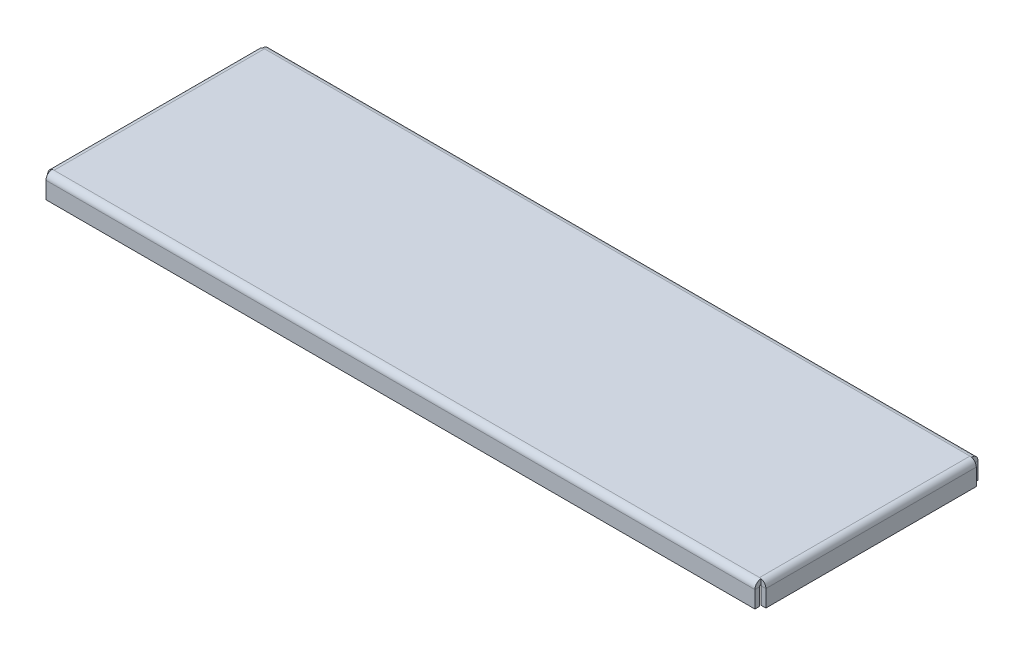
ISO-10303-21;
HEADER;
FILE_DESCRIPTION(('STEP AP214'),'2;1');
FILE_NAME('part.step','',(''),(''),'','','');
FILE_SCHEMA(('AUTOMOTIVE_DESIGN { 1 0 10303 214 1 1 1 1 }'));
ENDSEC;
DATA;
#1=APPLICATION_CONTEXT('core data for automotive mechanical design processes');
#2=APPLICATION_PROTOCOL_DEFINITION('international standard','automotive_design',2000,#1);
#3=PRODUCT_CONTEXT('',#1,'mechanical');
#4=PRODUCT('Part','Part','',(#3));
#5=PRODUCT_RELATED_PRODUCT_CATEGORY('part','',(#4));
#6=PRODUCT_DEFINITION_FORMATION('','',#4);
#7=PRODUCT_DEFINITION_CONTEXT('part definition',#1,'design');
#8=PRODUCT_DEFINITION('design','',#6,#7);
#9=PRODUCT_DEFINITION_SHAPE('','',#8);
#10=(LENGTH_UNIT() NAMED_UNIT(*) SI_UNIT(.MILLI.,.METRE.));
#11=(NAMED_UNIT(*) PLANE_ANGLE_UNIT() SI_UNIT($,.RADIAN.));
#12=(NAMED_UNIT(*) SI_UNIT($,.STERADIAN.) SOLID_ANGLE_UNIT());
#13=UNCERTAINTY_MEASURE_WITH_UNIT(LENGTH_MEASURE(1.E-05),#10,'distance_accuracy_value','');
#14=(GEOMETRIC_REPRESENTATION_CONTEXT(3) GLOBAL_UNCERTAINTY_ASSIGNED_CONTEXT((#13)) GLOBAL_UNIT_ASSIGNED_CONTEXT((#10,
#11,#12)) REPRESENTATION_CONTEXT('',''));
#15=CARTESIAN_POINT('',(0.,0.,0.));
#16=DIRECTION('',(0.,0.,1.));
#17=DIRECTION('',(1.,0.,0.));
#18=AXIS2_PLACEMENT_3D('',#15,#16,#17);
#19=CARTESIAN_POINT('',(152.5,3.,-2.7366));
#20=DIRECTION('',(0.,0.,-1.));
#21=DIRECTION('',(-1.,0.,0.));
#22=AXIS2_PLACEMENT_3D('',#19,#20,#21);
#23=PLANE('',#22);
#24=DIRECTION('',(0.,-1.,0.));
#25=VECTOR('',#24,1.);
#26=CARTESIAN_POINT('',(152.5,3.,-2.7366));
#27=LINE('',#26,#25);
#28=CARTESIAN_POINT('',(152.5,4.89900239793484,-2.73659999999999));
#29=VERTEX_POINT('',#28);
#30=CARTESIAN_POINT('',(152.5,5.,-2.73659999999999));
#31=VERTEX_POINT('',#30);
#32=EDGE_CURVE('E104',#29,#31,#27,.F.);
#33=ORIENTED_EDGE('',*,*,#32,.F.);
#34=CARTESIAN_POINT('',(151.7634,2.26339999999997,-2.73660000000001));
#35=DIRECTION('',(0.,0.,1.));
#36=DIRECTION('',(0.,-1.,0.));
#37=AXIS2_PLACEMENT_3D('',#34,#35,#36);
#38=CIRCLE('',#37,2.7366);
#39=CARTESIAN_POINT('',(151.7634,5.,-2.7366));
#40=VERTEX_POINT('',#39);
#41=EDGE_CURVE('E13',#29,#40,#38,.T.);
#42=ORIENTED_EDGE('',*,*,#41,.T.);
#43=DIRECTION('',(1.,0.,0.));
#44=VECTOR('',#43,1.);
#45=CARTESIAN_POINT('',(-152.5,5.,-2.73659999999999));
#46=LINE('',#45,#44);
#47=EDGE_CURVE('E502',#31,#40,#46,.F.);
#48=ORIENTED_EDGE('',*,*,#47,.F.);
#49=EDGE_LOOP('',(#33,#42,#48));
#50=FACE_BOUND('',#49,.T.);
#51=ADVANCED_FACE('F86',(#50),#23,.T.);
#52=CARTESIAN_POINT('',(151.7634,3.0000000000003,-93.2634));
#53=DIRECTION('',(0.,0.,1.));
#54=DIRECTION('',(0.,-1.,0.));
#55=AXIS2_PLACEMENT_3D('',#52,#53,#54);
#56=PLANE('',#55);
#57=DIRECTION('',(1.,0.,0.));
#58=VECTOR('',#57,1.);
#59=CARTESIAN_POINT('',(152.5,5.0000000000003,-93.2634));
#60=LINE('',#59,#58);
#61=CARTESIAN_POINT('',(152.5,5.0000000000003,-93.2634));
#62=VERTEX_POINT('',#61);
#63=CARTESIAN_POINT('',(151.7634,5.0000000000003,-93.2634));
#64=VERTEX_POINT('',#63);
#65=EDGE_CURVE('E470',#62,#64,#60,.F.);
#66=ORIENTED_EDGE('',*,*,#65,.T.);
#67=CARTESIAN_POINT('',(151.7634,2.26340000000029,-93.2634));
#68=DIRECTION('',(0.,0.,1.));
#69=DIRECTION('',(0.,-1.,0.));
#70=AXIS2_PLACEMENT_3D('',#67,#68,#69);
#71=CIRCLE('',#70,2.7366);
#72=CARTESIAN_POINT('',(152.5,4.89900239793516,-93.2634));
#73=VERTEX_POINT('',#72);
#74=EDGE_CURVE('E332',#64,#73,#71,.F.);
#75=ORIENTED_EDGE('',*,*,#74,.T.);
#76=DIRECTION('',(0.,1.,0.));
#77=VECTOR('',#76,1.);
#78=CARTESIAN_POINT('',(152.5,3.0000000000003,-93.2634));
#79=LINE('',#78,#77);
#80=EDGE_CURVE('E477',#73,#62,#79,.T.);
#81=ORIENTED_EDGE('',*,*,#80,.T.);
#82=EDGE_LOOP('',(#66,#75,#81));
#83=FACE_BOUND('',#82,.T.);
#84=ADVANCED_FACE('F633',(#83),#56,.T.);
#85=CARTESIAN_POINT('',(0.,4.99999999999999,0.));
#86=DIRECTION('',(0.,-1.,0.));
#87=DIRECTION('',(0.,0.,-1.));
#88=AXIS2_PLACEMENT_3D('',#85,#86,#87);
#89=PLANE('',#88);
#90=DIRECTION('',(0.,0.,1.));
#91=VECTOR('',#90,1.);
#92=CARTESIAN_POINT('',(151.7634,4.99999999999998,-2.73659999999998));
#93=LINE('',#92,#91);
#94=EDGE_CURVE('E273',#40,#64,#93,.F.);
#95=ORIENTED_EDGE('',*,*,#94,.T.);
#96=CARTESIAN_POINT('',(-151.7634,5.0000000000003,-93.2634));
#97=VERTEX_POINT('',#96);
#98=EDGE_CURVE('E473',#64,#97,#60,.F.);
#99=ORIENTED_EDGE('',*,*,#98,.T.);
#100=DIRECTION('',(0.,0.,-1.));
#101=VECTOR('',#100,1.);
#102=CARTESIAN_POINT('',(-151.7634,5.00000000000031,-93.2634));
#103=LINE('',#102,#101);
#104=CARTESIAN_POINT('',(-151.7634,5.,-2.73659999999999));
#105=VERTEX_POINT('',#104);
#106=EDGE_CURVE('E391',#97,#105,#103,.F.);
#107=ORIENTED_EDGE('',*,*,#106,.T.);
#108=EDGE_CURVE('E507',#40,#105,#46,.F.);
#109=ORIENTED_EDGE('',*,*,#108,.F.);
#110=EDGE_LOOP('',(#95,#99,#107,#109));
#111=FACE_BOUND('',#110,.T.);
#112=ADVANCED_FACE('F639',(#111),#89,.F.);
#113=CARTESIAN_POINT('',(0.,2.99999999999999,0.));
#114=DIRECTION('',(0.,-1.,0.));
#115=DIRECTION('',(0.,0.,-1.));
#116=AXIS2_PLACEMENT_3D('',#113,#114,#115);
#117=PLANE('',#116);
#118=DIRECTION('',(1.,0.,0.));
#119=VECTOR('',#118,1.);
#120=CARTESIAN_POINT('',(152.5,3.0000000000003,-93.2634));
#121=LINE('',#120,#119);
#122=CARTESIAN_POINT('',(151.7634,3.0000000000003,-93.2634));
#123=VERTEX_POINT('',#122);
#124=CARTESIAN_POINT('',(-151.7634,3.00000000000031,-93.2634));
#125=VERTEX_POINT('',#124);
#126=EDGE_CURVE('E112',#123,#125,#121,.F.);
#127=ORIENTED_EDGE('',*,*,#126,.F.);
#128=DIRECTION('',(0.,0.,1.));
#129=VECTOR('',#128,1.);
#130=CARTESIAN_POINT('',(151.7634,2.99999999999998,-2.73659999999998));
#131=LINE('',#130,#129);
#132=CARTESIAN_POINT('',(151.7634,2.99999999999998,-2.7366));
#133=VERTEX_POINT('',#132);
#134=EDGE_CURVE('E340',#133,#123,#131,.F.);
#135=ORIENTED_EDGE('',*,*,#134,.F.);
#136=DIRECTION('',(1.,0.,0.));
#137=VECTOR('',#136,1.);
#138=CARTESIAN_POINT('',(-152.5,3.,-2.7366));
#139=LINE('',#138,#137);
#140=CARTESIAN_POINT('',(-151.7634,2.99999999999999,-2.73659999999999));
#141=VERTEX_POINT('',#140);
#142=EDGE_CURVE('E515',#141,#133,#139,.T.);
#143=ORIENTED_EDGE('',*,*,#142,.F.);
#144=DIRECTION('',(0.,0.,-1.));
#145=VECTOR('',#144,1.);
#146=CARTESIAN_POINT('',(-151.7634,3.00000000000031,-93.2634));
#147=LINE('',#146,#145);
#148=EDGE_CURVE('E409',#125,#141,#147,.F.);
#149=ORIENTED_EDGE('',*,*,#148,.F.);
#150=EDGE_LOOP('',(#127,#135,#143,#149));
#151=FACE_BOUND('',#150,.T.);
#152=ADVANCED_FACE('F714',(#151),#117,.T.);
#153=CARTESIAN_POINT('',(-152.5,3.0000000000003,-93.2634));
#154=DIRECTION('',(0.,0.,1.));
#155=DIRECTION('',(0.,-1.,0.));
#156=AXIS2_PLACEMENT_3D('',#153,#154,#155);
#157=PLANE('',#156);
#158=DIRECTION('',(0.,1.,0.));
#159=VECTOR('',#158,1.);
#160=CARTESIAN_POINT('',(-152.5,3.0000000000003,-93.2634));
#161=LINE('',#160,#159);
#162=CARTESIAN_POINT('',(-152.5,4.89900239793517,-93.2634));
#163=VERTEX_POINT('',#162);
#164=CARTESIAN_POINT('',(-152.5,5.0000000000003,-93.2634));
#165=VERTEX_POINT('',#164);
#166=EDGE_CURVE('E497',#163,#165,#161,.T.);
#167=ORIENTED_EDGE('',*,*,#166,.F.);
#168=CARTESIAN_POINT('',(-151.7634,2.26340000000031,-93.2634));
#169=DIRECTION('',(0.,0.,-1.));
#170=DIRECTION('',(0.,1.,0.));
#171=AXIS2_PLACEMENT_3D('',#168,#169,#170);
#172=CIRCLE('',#171,2.7366);
#173=EDGE_CURVE('E96',#163,#97,#172,.T.);
#174=ORIENTED_EDGE('',*,*,#173,.T.);
#175=DIRECTION('',(1.,0.,0.));
#176=VECTOR('',#175,1.);
#177=CARTESIAN_POINT('',(152.5,5.0000000000003,-93.2634));
#178=LINE('',#177,#176);
#179=EDGE_CURVE('E419',#165,#97,#178,.T.);
#180=ORIENTED_EDGE('',*,*,#179,.F.);
#181=EDGE_LOOP('',(#167,#174,#180));
#182=FACE_BOUND('',#181,.T.);
#183=ADVANCED_FACE('F710',(#182),#157,.T.);
#184=CARTESIAN_POINT('',(-151.7634,2.99999999999999,-2.73659999999999));
#185=DIRECTION('',(0.,0.,-1.));
#186=DIRECTION('',(-1.,0.,0.));
#187=AXIS2_PLACEMENT_3D('',#184,#185,#186);
#188=PLANE('',#187);
#189=DIRECTION('',(1.,0.,0.));
#190=VECTOR('',#189,1.);
#191=CARTESIAN_POINT('',(152.5,5.,-2.73659999999784));
#192=LINE('',#191,#190);
#193=CARTESIAN_POINT('',(-152.5,5.,-2.73659999999999));
#194=VERTEX_POINT('',#193);
#195=EDGE_CURVE('E423',#105,#194,#192,.F.);
#196=ORIENTED_EDGE('',*,*,#195,.F.);
#197=CARTESIAN_POINT('',(-151.7634,2.26339999999999,-2.73659999999999));
#198=DIRECTION('',(0.,0.,-1.));
#199=DIRECTION('',(0.,1.,0.));
#200=AXIS2_PLACEMENT_3D('',#197,#198,#199);
#201=CIRCLE('',#200,2.7366);
#202=CARTESIAN_POINT('',(-152.5,4.89900239793486,-2.73659999999998));
#203=VERTEX_POINT('',#202);
#204=EDGE_CURVE('E397',#105,#203,#201,.F.);
#205=ORIENTED_EDGE('',*,*,#204,.T.);
#206=DIRECTION('',(0.,-1.,0.));
#207=VECTOR('',#206,1.);
#208=CARTESIAN_POINT('',(-152.5,5.,-2.73659999999999));
#209=LINE('',#208,#207);
#210=EDGE_CURVE('E496',#203,#194,#209,.F.);
#211=ORIENTED_EDGE('',*,*,#210,.T.);
#212=EDGE_LOOP('',(#196,#205,#211));
#213=FACE_BOUND('',#212,.T.);
#214=ADVANCED_FACE('F707',(#213),#188,.T.);
#215=CARTESIAN_POINT('',(152.5,5.,-2.));
#216=DIRECTION('',(1.,0.,0.));
#217=DIRECTION('',(0.,0.,-1.));
#218=AXIS2_PLACEMENT_3D('',#215,#216,#217);
#219=PLANE('',#218);
#220=DIRECTION('',(0.,1.,0.));
#221=VECTOR('',#220,1.);
#222=CARTESIAN_POINT('',(152.5,5.,-2.));
#223=LINE('',#222,#221);
#224=CARTESIAN_POINT('',(152.5,-5.,-2.));
#225=VERTEX_POINT('',#224);
#226=CARTESIAN_POINT('',(152.5,2.2634,-2.));
#227=VERTEX_POINT('',#226);
#228=EDGE_CURVE('E559',#225,#227,#223,.T.);
#229=ORIENTED_EDGE('',*,*,#228,.T.);
#230=DIRECTION('',(0.,0.,1.));
#231=VECTOR('',#230,1.);
#232=CARTESIAN_POINT('',(152.5,2.2634,-2.));
#233=LINE('',#232,#231);
#234=CARTESIAN_POINT('',(152.5,2.2634,0.));
#235=VERTEX_POINT('',#234);
#236=EDGE_CURVE('E529',#227,#235,#233,.T.);
#237=ORIENTED_EDGE('',*,*,#236,.T.);
#238=DIRECTION('',(0.,1.,0.));
#239=VECTOR('',#238,1.);
#240=CARTESIAN_POINT('',(152.5,5.,0.));
#241=LINE('',#240,#239);
#242=CARTESIAN_POINT('',(152.5,-5.,0.));
#243=VERTEX_POINT('',#242);
#244=EDGE_CURVE('E555',#243,#235,#241,.T.);
#245=ORIENTED_EDGE('',*,*,#244,.F.);
#246=DIRECTION('',(0.,0.,1.));
#247=VECTOR('',#246,1.);
#248=CARTESIAN_POINT('',(152.5,-5.,-2.));
#249=LINE('',#248,#247);
#250=EDGE_CURVE('E571',#225,#243,#249,.T.);
#251=ORIENTED_EDGE('',*,*,#250,.F.);
#252=EDGE_LOOP('',(#229,#237,#245,#251));
#253=FACE_BOUND('',#252,.T.);
#254=ADVANCED_FACE('F598',(#253),#219,.T.);
#255=CARTESIAN_POINT('',(0.,0.,-2.));
#256=DIRECTION('',(0.,0.,1.));
#257=DIRECTION('',(1.,0.,0.));
#258=AXIS2_PLACEMENT_3D('',#255,#256,#257);
#259=PLANE('',#258);
#260=DIRECTION('',(1.,0.,0.));
#261=VECTOR('',#260,1.);
#262=CARTESIAN_POINT('',(152.5,2.2634,-2.));
#263=LINE('',#262,#261);
#264=CARTESIAN_POINT('',(-152.5,2.2634,-2.));
#265=VERTEX_POINT('',#264);
#266=EDGE_CURVE('E537',#227,#265,#263,.F.);
#267=ORIENTED_EDGE('',*,*,#266,.F.);
#268=ORIENTED_EDGE('',*,*,#228,.F.);
#269=DIRECTION('',(1.,0.,0.));
#270=VECTOR('',#269,1.);
#271=CARTESIAN_POINT('',(-152.5,-5.,-2.));
#272=LINE('',#271,#270);
#273=CARTESIAN_POINT('',(-152.5,-5.,-2.));
#274=VERTEX_POINT('',#273);
#275=EDGE_CURVE('E554',#274,#225,#272,.T.);
#276=ORIENTED_EDGE('',*,*,#275,.F.);
#277=DIRECTION('',(0.,-1.,0.));
#278=VECTOR('',#277,1.);
#279=CARTESIAN_POINT('',(-152.5,5.,-2.));
#280=LINE('',#279,#278);
#281=EDGE_CURVE('E551',#265,#274,#280,.T.);
#282=ORIENTED_EDGE('',*,*,#281,.F.);
#283=EDGE_LOOP('',(#267,#268,#276,#282));
#284=FACE_BOUND('',#283,.T.);
#285=ADVANCED_FACE('F602',(#284),#259,.F.);
#286=CARTESIAN_POINT('',(0.,0.,0.));
#287=DIRECTION('',(0.,0.,1.));
#288=DIRECTION('',(1.,0.,0.));
#289=AXIS2_PLACEMENT_3D('',#286,#287,#288);
#290=PLANE('',#289);
#291=ORIENTED_EDGE('',*,*,#244,.T.);
#292=DIRECTION('',(1.,0.,0.));
#293=VECTOR('',#292,1.);
#294=CARTESIAN_POINT('',(152.5,2.2634,0.));
#295=LINE('',#294,#293);
#296=CARTESIAN_POINT('',(-152.5,2.2634,0.));
#297=VERTEX_POINT('',#296);
#298=EDGE_CURVE('E520',#235,#297,#295,.F.);
#299=ORIENTED_EDGE('',*,*,#298,.T.);
#300=DIRECTION('',(0.,-1.,0.));
#301=VECTOR('',#300,1.);
#302=CARTESIAN_POINT('',(-152.5,5.,0.));
#303=LINE('',#302,#301);
#304=CARTESIAN_POINT('',(-152.5,-5.,0.));
#305=VERTEX_POINT('',#304);
#306=EDGE_CURVE('E547',#297,#305,#303,.T.);
#307=ORIENTED_EDGE('',*,*,#306,.T.);
#308=DIRECTION('',(1.,0.,0.));
#309=VECTOR('',#308,1.);
#310=CARTESIAN_POINT('',(-152.5,-5.,0.));
#311=LINE('',#310,#309);
#312=EDGE_CURVE('E565',#305,#243,#311,.T.);
#313=ORIENTED_EDGE('',*,*,#312,.T.);
#314=EDGE_LOOP('',(#291,#299,#307,#313));
#315=FACE_BOUND('',#314,.T.);
#316=ADVANCED_FACE('F590',(#315),#290,.T.);
#317=CARTESIAN_POINT('',(-152.5,5.,-2.));
#318=DIRECTION('',(-1.,0.,0.));
#319=DIRECTION('',(0.,0.,1.));
#320=AXIS2_PLACEMENT_3D('',#317,#318,#319);
#321=PLANE('',#320);
#322=DIRECTION('',(0.,0.,1.));
#323=VECTOR('',#322,1.);
#324=CARTESIAN_POINT('',(-152.5,2.2634,-2.));
#325=LINE('',#324,#323);
#326=EDGE_CURVE('E543',#265,#297,#325,.T.);
#327=ORIENTED_EDGE('',*,*,#326,.F.);
#328=ORIENTED_EDGE('',*,*,#281,.T.);
#329=DIRECTION('',(0.,0.,1.));
#330=VECTOR('',#329,1.);
#331=CARTESIAN_POINT('',(-152.5,-5.,-2.));
#332=LINE('',#331,#330);
#333=EDGE_CURVE('E90',#274,#305,#332,.T.);
#334=ORIENTED_EDGE('',*,*,#333,.T.);
#335=ORIENTED_EDGE('',*,*,#306,.F.);
#336=EDGE_LOOP('',(#327,#328,#334,#335));
#337=FACE_BOUND('',#336,.T.);
#338=ADVANCED_FACE('F88',(#337),#321,.T.);
#339=CARTESIAN_POINT('',(-152.5,-5.,-2.));
#340=DIRECTION('',(0.,-1.,0.));
#341=DIRECTION('',(0.,0.,-1.));
#342=AXIS2_PLACEMENT_3D('',#339,#340,#341);
#343=PLANE('',#342);
#344=ORIENTED_EDGE('',*,*,#312,.F.);
#345=ORIENTED_EDGE('',*,*,#333,.F.);
#346=ORIENTED_EDGE('',*,*,#275,.T.);
#347=ORIENTED_EDGE('',*,*,#250,.T.);
#348=EDGE_LOOP('',(#344,#345,#346,#347));
#349=FACE_BOUND('',#348,.T.);
#350=ADVANCED_FACE('F588',(#349),#343,.T.);
#351=CARTESIAN_POINT('',(-152.5,2.2634,-2.7366));
#352=DIRECTION('',(-1.,0.,0.));
#353=DIRECTION('',(0.,0.,1.));
#354=AXIS2_PLACEMENT_3D('',#351,#352,#353);
#355=PLANE('',#354);
#356=CARTESIAN_POINT('',(-152.5,3.,-2.7366));
#357=VERTEX_POINT('',#356);
#358=EDGE_CURVE('E516',#357,#203,#209,.F.);
#359=ORIENTED_EDGE('',*,*,#358,.F.);
#360=CARTESIAN_POINT('',(-152.5,2.2634,-2.7366));
#361=DIRECTION('',(1.,0.,0.));
#362=DIRECTION('',(0.,0.,-1.));
#363=AXIS2_PLACEMENT_3D('',#360,#361,#362);
#364=CIRCLE('',#363,0.7366);
#365=EDGE_CURVE('E533',#265,#357,#364,.F.);
#366=ORIENTED_EDGE('',*,*,#365,.F.);
#367=ORIENTED_EDGE('',*,*,#326,.T.);
#368=CARTESIAN_POINT('',(-152.5,2.2634,-2.7366));
#369=DIRECTION('',(1.,0.,0.));
#370=DIRECTION('',(0.,0.,-1.));
#371=AXIS2_PLACEMENT_3D('',#368,#369,#370);
#372=CIRCLE('',#371,2.7366);
#373=EDGE_CURVE('E524',#297,#194,#372,.F.);
#374=ORIENTED_EDGE('',*,*,#373,.T.);
#375=ORIENTED_EDGE('',*,*,#210,.F.);
#376=EDGE_LOOP('',(#359,#366,#367,#374,#375));
#377=FACE_BOUND('',#376,.T.);
#378=ADVANCED_FACE('F608',(#377),#355,.T.);
#379=CARTESIAN_POINT('',(152.5,2.2634,-2.7366));
#380=DIRECTION('',(-1.,0.,0.));
#381=DIRECTION('',(0.,0.,1.));
#382=AXIS2_PLACEMENT_3D('',#379,#380,#381);
#383=PLANE('',#382);
#384=CARTESIAN_POINT('',(152.5,2.2634,-2.7366));
#385=DIRECTION('',(1.,0.,0.));
#386=DIRECTION('',(0.,0.,-1.));
#387=AXIS2_PLACEMENT_3D('',#384,#385,#386);
#388=CIRCLE('',#387,0.7366);
#389=CARTESIAN_POINT('',(152.5,3.,-2.7366));
#390=VERTEX_POINT('',#389);
#391=EDGE_CURVE('E506',#390,#227,#388,.T.);
#392=ORIENTED_EDGE('',*,*,#391,.F.);
#393=EDGE_CURVE('E508',#390,#29,#27,.F.);
#394=ORIENTED_EDGE('',*,*,#393,.T.);
#395=ORIENTED_EDGE('',*,*,#32,.T.);
#396=CARTESIAN_POINT('',(152.5,2.2634,-2.7366));
#397=DIRECTION('',(1.,0.,0.));
#398=DIRECTION('',(0.,0.,-1.));
#399=AXIS2_PLACEMENT_3D('',#396,#397,#398);
#400=CIRCLE('',#399,2.7366);
#401=EDGE_CURVE('E525',#31,#235,#400,.T.);
#402=ORIENTED_EDGE('',*,*,#401,.T.);
#403=ORIENTED_EDGE('',*,*,#236,.F.);
#404=EDGE_LOOP('',(#392,#394,#395,#402,#403));
#405=FACE_BOUND('',#404,.T.);
#406=ADVANCED_FACE('F596',(#405),#383,.F.);
#407=CARTESIAN_POINT('',(152.5,2.2634,-2.7366));
#408=DIRECTION('',(1.,0.,0.));
#409=DIRECTION('',(0.,1.,0.));
#410=AXIS2_PLACEMENT_3D('',#407,#408,#409);
#411=CYLINDRICAL_SURFACE('',#410,2.7366);
#412=ORIENTED_EDGE('',*,*,#298,.F.);
#413=ORIENTED_EDGE('',*,*,#401,.F.);
#414=ORIENTED_EDGE('',*,*,#47,.T.);
#415=ORIENTED_EDGE('',*,*,#108,.T.);
#416=ORIENTED_EDGE('',*,*,#195,.T.);
#417=ORIENTED_EDGE('',*,*,#373,.F.);
#418=EDGE_LOOP('',(#412,#413,#414,#415,#416,#417));
#419=FACE_BOUND('',#418,.T.);
#420=ADVANCED_FACE('F593',(#419),#411,.T.);
#421=CARTESIAN_POINT('',(152.5,2.2634,-2.7366));
#422=DIRECTION('',(1.,0.,0.));
#423=DIRECTION('',(0.,1.,0.));
#424=AXIS2_PLACEMENT_3D('',#421,#422,#423);
#425=CYLINDRICAL_SURFACE('',#424,0.7366);
#426=ORIENTED_EDGE('',*,*,#266,.T.);
#427=ORIENTED_EDGE('',*,*,#365,.T.);
#428=EDGE_CURVE('E511',#357,#141,#139,.T.);
#429=ORIENTED_EDGE('',*,*,#428,.T.);
#430=ORIENTED_EDGE('',*,*,#142,.T.);
#431=DIRECTION('',(-1.,0.,0.));
#432=VECTOR('',#431,1.);
#433=CARTESIAN_POINT('',(152.5,3.,-2.7366));
#434=LINE('',#433,#432);
#435=EDGE_CURVE('E335',#390,#133,#434,.T.);
#436=ORIENTED_EDGE('',*,*,#435,.F.);
#437=ORIENTED_EDGE('',*,*,#391,.T.);
#438=EDGE_LOOP('',(#426,#427,#429,#430,#436,#437));
#439=FACE_BOUND('',#438,.T.);
#440=ADVANCED_FACE('F605',(#439),#425,.F.);
#441=CARTESIAN_POINT('',(-152.5,2.2634000000003,-93.2634));
#442=DIRECTION('',(-1.,0.,0.));
#443=DIRECTION('',(0.,0.,1.));
#444=AXIS2_PLACEMENT_3D('',#441,#442,#443);
#445=PLANE('',#444);
#446=DIRECTION('',(0.,0.,1.));
#447=VECTOR('',#446,1.);
#448=CARTESIAN_POINT('',(-152.5,2.26340000000032,-96.));
#449=LINE('',#448,#447);
#450=CARTESIAN_POINT('',(-152.5,2.2634000000003,-94.));
#451=VERTEX_POINT('',#450);
#452=CARTESIAN_POINT('',(-152.5,2.26340000000032,-96.));
#453=VERTEX_POINT('',#452);
#454=EDGE_CURVE('E427',#451,#453,#449,.F.);
#455=ORIENTED_EDGE('',*,*,#454,.F.);
#456=CARTESIAN_POINT('',(-152.5,2.2634000000003,-93.2634));
#457=DIRECTION('',(1.,0.,0.));
#458=DIRECTION('',(0.,0.,-1.));
#459=AXIS2_PLACEMENT_3D('',#456,#457,#458);
#460=CIRCLE('',#459,0.736600000000004);
#461=CARTESIAN_POINT('',(-152.5,3.0000000000003,-93.2634));
#462=VERTEX_POINT('',#461);
#463=EDGE_CURVE('E482',#462,#451,#460,.F.);
#464=ORIENTED_EDGE('',*,*,#463,.F.);
#465=EDGE_CURVE('E492',#462,#163,#161,.T.);
#466=ORIENTED_EDGE('',*,*,#465,.T.);
#467=ORIENTED_EDGE('',*,*,#166,.T.);
#468=CARTESIAN_POINT('',(-152.5,2.2634000000003,-93.2634));
#469=DIRECTION('',(1.,0.,0.));
#470=DIRECTION('',(0.,0.,-1.));
#471=AXIS2_PLACEMENT_3D('',#468,#469,#470);
#472=CIRCLE('',#471,2.7366);
#473=EDGE_CURVE('E472',#165,#453,#472,.F.);
#474=ORIENTED_EDGE('',*,*,#473,.T.);
#475=EDGE_LOOP('',(#455,#464,#466,#467,#474));
#476=FACE_BOUND('',#475,.T.);
#477=ADVANCED_FACE('F742',(#476),#445,.T.);
#478=CARTESIAN_POINT('',(152.5,2.2634000000003,-93.2634));
#479=DIRECTION('',(-1.,0.,0.));
#480=DIRECTION('',(0.,0.,1.));
#481=AXIS2_PLACEMENT_3D('',#478,#479,#480);
#482=PLANE('',#481);
#483=CARTESIAN_POINT('',(152.5,2.2634000000003,-93.2634));
#484=DIRECTION('',(1.,0.,0.));
#485=DIRECTION('',(0.,0.,-1.));
#486=AXIS2_PLACEMENT_3D('',#483,#484,#485);
#487=CIRCLE('',#486,0.736600000000004);
#488=CARTESIAN_POINT('',(152.5,2.2634000000003,-94.));
#489=VERTEX_POINT('',#488);
#490=CARTESIAN_POINT('',(152.5,3.00000000000032,-93.2634));
#491=VERTEX_POINT('',#490);
#492=EDGE_CURVE('E432',#489,#491,#487,.T.);
#493=ORIENTED_EDGE('',*,*,#492,.F.);
#494=DIRECTION('',(0.,0.,1.));
#495=VECTOR('',#494,1.);
#496=CARTESIAN_POINT('',(152.5,2.2634000000003,-94.));
#497=LINE('',#496,#495);
#498=CARTESIAN_POINT('',(152.5,2.26340000000031,-96.));
#499=VERTEX_POINT('',#498);
#500=EDGE_CURVE('E460',#489,#499,#497,.F.);
#501=ORIENTED_EDGE('',*,*,#500,.T.);
#502=CARTESIAN_POINT('',(152.5,2.2634000000003,-93.2634));
#503=DIRECTION('',(1.,0.,0.));
#504=DIRECTION('',(0.,0.,-1.));
#505=AXIS2_PLACEMENT_3D('',#502,#503,#504);
#506=CIRCLE('',#505,2.7366);
#507=EDGE_CURVE('E478',#499,#62,#506,.T.);
#508=ORIENTED_EDGE('',*,*,#507,.T.);
#509=ORIENTED_EDGE('',*,*,#80,.F.);
#510=EDGE_CURVE('E498',#491,#73,#79,.T.);
#511=ORIENTED_EDGE('',*,*,#510,.F.);
#512=EDGE_LOOP('',(#493,#501,#508,#509,#511));
#513=FACE_BOUND('',#512,.T.);
#514=ADVANCED_FACE('F738',(#513),#482,.F.);
#515=CARTESIAN_POINT('',(152.5,2.2634000000003,-93.2634));
#516=DIRECTION('',(1.,0.,0.));
#517=DIRECTION('',(0.,0.,-1.));
#518=AXIS2_PLACEMENT_3D('',#515,#516,#517);
#519=CYLINDRICAL_SURFACE('',#518,2.7366);
#520=ORIENTED_EDGE('',*,*,#65,.F.);
#521=ORIENTED_EDGE('',*,*,#507,.F.);
#522=DIRECTION('',(1.,0.,0.));
#523=VECTOR('',#522,1.);
#524=CARTESIAN_POINT('',(-152.5,2.26340000000032,-96.));
#525=LINE('',#524,#523);
#526=EDGE_CURVE('E457',#499,#453,#525,.F.);
#527=ORIENTED_EDGE('',*,*,#526,.T.);
#528=ORIENTED_EDGE('',*,*,#473,.F.);
#529=ORIENTED_EDGE('',*,*,#179,.T.);
#530=ORIENTED_EDGE('',*,*,#98,.F.);
#531=EDGE_LOOP('',(#520,#521,#527,#528,#529,#530));
#532=FACE_BOUND('',#531,.T.);
#533=ADVANCED_FACE('F640',(#532),#519,.T.);
#534=CARTESIAN_POINT('',(152.5,2.2634000000003,-93.2634));
#535=DIRECTION('',(1.,0.,0.));
#536=DIRECTION('',(0.,0.,-1.));
#537=AXIS2_PLACEMENT_3D('',#534,#535,#536);
#538=CYLINDRICAL_SURFACE('',#537,0.736600000000004);
#539=EDGE_CURVE('E486',#491,#123,#121,.F.);
#540=ORIENTED_EDGE('',*,*,#539,.T.);
#541=ORIENTED_EDGE('',*,*,#126,.T.);
#542=DIRECTION('',(1.,0.,0.));
#543=VECTOR('',#542,1.);
#544=CARTESIAN_POINT('',(-152.5,3.0000000000003,-93.2634));
#545=LINE('',#544,#543);
#546=EDGE_CURVE('E401',#462,#125,#545,.T.);
#547=ORIENTED_EDGE('',*,*,#546,.F.);
#548=ORIENTED_EDGE('',*,*,#463,.T.);
#549=DIRECTION('',(1.,0.,0.));
#550=VECTOR('',#549,1.);
#551=CARTESIAN_POINT('',(-152.5,2.26340000000031,-94.));
#552=LINE('',#551,#550);
#553=EDGE_CURVE('E464',#451,#489,#552,.T.);
#554=ORIENTED_EDGE('',*,*,#553,.T.);
#555=ORIENTED_EDGE('',*,*,#492,.T.);
#556=EDGE_LOOP('',(#540,#541,#547,#548,#554,#555));
#557=FACE_BOUND('',#556,.T.);
#558=ADVANCED_FACE('F734',(#557),#538,.F.);
#559=CARTESIAN_POINT('',(152.5,-4.99999999999967,-96.0000000000001));
#560=DIRECTION('',(-1.,0.,0.));
#561=DIRECTION('',(0.,0.,1.));
#562=AXIS2_PLACEMENT_3D('',#559,#560,#561);
#563=PLANE('',#562);
#564=ORIENTED_EDGE('',*,*,#500,.F.);
#565=DIRECTION('',(0.,1.,0.));
#566=VECTOR('',#565,1.);
#567=CARTESIAN_POINT('',(152.5,-4.99999999999969,-94.0000000000001));
#568=LINE('',#567,#566);
#569=CARTESIAN_POINT('',(152.5,-4.99999999999969,-94.0000000000001));
#570=VERTEX_POINT('',#569);
#571=EDGE_CURVE('E454',#489,#570,#568,.F.);
#572=ORIENTED_EDGE('',*,*,#571,.T.);
#573=DIRECTION('',(0.,0.,1.));
#574=VECTOR('',#573,1.);
#575=CARTESIAN_POINT('',(152.5,-4.99999999999967,-96.0000000000001));
#576=LINE('',#575,#574);
#577=CARTESIAN_POINT('',(152.5,-4.99999999999967,-96.0000000000001));
#578=VERTEX_POINT('',#577);
#579=EDGE_CURVE('E428',#578,#570,#576,.T.);
#580=ORIENTED_EDGE('',*,*,#579,.F.);
#581=DIRECTION('',(0.,-1.,0.));
#582=VECTOR('',#581,1.);
#583=CARTESIAN_POINT('',(152.5,6.7311677745278E-13,-96.));
#584=LINE('',#583,#582);
#585=EDGE_CURVE('E444',#499,#578,#584,.T.);
#586=ORIENTED_EDGE('',*,*,#585,.F.);
#587=EDGE_LOOP('',(#564,#572,#580,#586));
#588=FACE_BOUND('',#587,.T.);
#589=ADVANCED_FACE('F727',(#588),#563,.F.);
#590=CARTESIAN_POINT('',(-152.5,3.00000000000033,-96.));
#591=DIRECTION('',(1.,0.,0.));
#592=DIRECTION('',(0.,0.,-1.));
#593=AXIS2_PLACEMENT_3D('',#590,#591,#592);
#594=PLANE('',#593);
#595=ORIENTED_EDGE('',*,*,#454,.T.);
#596=DIRECTION('',(0.,1.,0.));
#597=VECTOR('',#596,1.);
#598=CARTESIAN_POINT('',(-152.5,6.7311677745278E-13,-96.));
#599=LINE('',#598,#597);
#600=CARTESIAN_POINT('',(-152.5,-4.99999999999967,-96.0000000000001));
#601=VERTEX_POINT('',#600);
#602=EDGE_CURVE('E437',#601,#453,#599,.T.);
#603=ORIENTED_EDGE('',*,*,#602,.F.);
#604=DIRECTION('',(0.,0.,1.));
#605=VECTOR('',#604,1.);
#606=CARTESIAN_POINT('',(-152.5,-4.99999999999967,-96.0000000000001));
#607=LINE('',#606,#605);
#608=CARTESIAN_POINT('',(-152.5,-4.99999999999969,-94.0000000000001));
#609=VERTEX_POINT('',#608);
#610=EDGE_CURVE('E433',#601,#609,#607,.T.);
#611=ORIENTED_EDGE('',*,*,#610,.T.);
#612=DIRECTION('',(0.,-1.,0.));
#613=VECTOR('',#612,1.);
#614=CARTESIAN_POINT('',(-152.5,3.00000000000032,-94.));
#615=LINE('',#614,#613);
#616=EDGE_CURVE('E447',#609,#451,#615,.F.);
#617=ORIENTED_EDGE('',*,*,#616,.T.);
#618=EDGE_LOOP('',(#595,#603,#611,#617));
#619=FACE_BOUND('',#618,.T.);
#620=ADVANCED_FACE('F720',(#619),#594,.F.);
#621=CARTESIAN_POINT('',(0.,6.7311677745278E-13,-96.));
#622=DIRECTION('',(0.,0.,1.));
#623=DIRECTION('',(0.,-1.,0.));
#624=AXIS2_PLACEMENT_3D('',#621,#622,#623);
#625=PLANE('',#624);
#626=ORIENTED_EDGE('',*,*,#526,.F.);
#627=ORIENTED_EDGE('',*,*,#585,.T.);
#628=DIRECTION('',(-1.,0.,0.));
#629=VECTOR('',#628,1.);
#630=CARTESIAN_POINT('',(0.,-4.99999999999967,-96.0000000000001));
#631=LINE('',#630,#629);
#632=EDGE_CURVE('E441',#578,#601,#631,.T.);
#633=ORIENTED_EDGE('',*,*,#632,.T.);
#634=ORIENTED_EDGE('',*,*,#602,.T.);
#635=EDGE_LOOP('',(#626,#627,#633,#634));
#636=FACE_BOUND('',#635,.T.);
#637=ADVANCED_FACE('F716',(#636),#625,.F.);
#638=CARTESIAN_POINT('',(0.,6.59158011861059E-13,-94.));
#639=DIRECTION('',(0.,0.,1.));
#640=DIRECTION('',(0.,-1.,0.));
#641=AXIS2_PLACEMENT_3D('',#638,#639,#640);
#642=PLANE('',#641);
#643=ORIENTED_EDGE('',*,*,#571,.F.);
#644=ORIENTED_EDGE('',*,*,#553,.F.);
#645=ORIENTED_EDGE('',*,*,#616,.F.);
#646=DIRECTION('',(1.,0.,0.));
#647=VECTOR('',#646,1.);
#648=CARTESIAN_POINT('',(-152.5,-4.99999999999969,-94.0000000000001));
#649=LINE('',#648,#647);
#650=EDGE_CURVE('E451',#570,#609,#649,.F.);
#651=ORIENTED_EDGE('',*,*,#650,.F.);
#652=EDGE_LOOP('',(#643,#644,#645,#651));
#653=FACE_BOUND('',#652,.T.);
#654=ADVANCED_FACE('F719',(#653),#642,.T.);
#655=CARTESIAN_POINT('',(-152.5,-4.99999999999967,-96.0000000000001));
#656=DIRECTION('',(0.,1.,0.));
#657=DIRECTION('',(0.,0.,1.));
#658=AXIS2_PLACEMENT_3D('',#655,#656,#657);
#659=PLANE('',#658);
#660=ORIENTED_EDGE('',*,*,#650,.T.);
#661=ORIENTED_EDGE('',*,*,#610,.F.);
#662=ORIENTED_EDGE('',*,*,#632,.F.);
#663=ORIENTED_EDGE('',*,*,#579,.T.);
#664=EDGE_LOOP('',(#660,#661,#662,#663));
#665=FACE_BOUND('',#664,.T.);
#666=ADVANCED_FACE('F705',(#665),#659,.F.);
#667=CARTESIAN_POINT('',(-151.7634,2.26340000000031,-93.2634));
#668=DIRECTION('',(0.,0.,1.));
#669=DIRECTION('',(0.,-1.,0.));
#670=AXIS2_PLACEMENT_3D('',#667,#668,#669);
#671=PLANE('',#670);
#672=ORIENTED_EDGE('',*,*,#465,.F.);
#673=ORIENTED_EDGE('',*,*,#546,.T.);
#674=CARTESIAN_POINT('',(-151.7634,2.26340000000031,-93.2634));
#675=DIRECTION('',(0.,0.,-1.));
#676=DIRECTION('',(0.,1.,0.));
#677=AXIS2_PLACEMENT_3D('',#674,#675,#676);
#678=CIRCLE('',#677,0.736600000000004);
#679=CARTESIAN_POINT('',(-152.5,2.26340000000031,-93.2634));
#680=VERTEX_POINT('',#679);
#681=EDGE_CURVE('E390',#680,#125,#678,.T.);
#682=ORIENTED_EDGE('',*,*,#681,.F.);
#683=DIRECTION('',(-1.,0.,0.));
#684=VECTOR('',#683,1.);
#685=CARTESIAN_POINT('',(-152.5,2.2634000000003,-93.2634));
#686=LINE('',#685,#684);
#687=CARTESIAN_POINT('',(-154.5,2.26340000000031,-93.2634));
#688=VERTEX_POINT('',#687);
#689=EDGE_CURVE('E352',#680,#688,#686,.T.);
#690=ORIENTED_EDGE('',*,*,#689,.T.);
#691=EDGE_CURVE('E396',#688,#163,#172,.T.);
#692=ORIENTED_EDGE('',*,*,#691,.T.);
#693=EDGE_LOOP('',(#672,#673,#682,#690,#692));
#694=FACE_BOUND('',#693,.T.);
#695=ADVANCED_FACE('F702',(#694),#671,.F.);
#696=CARTESIAN_POINT('',(-151.7634,2.26339999999999,-2.73659999999999));
#697=DIRECTION('',(0.,0.,1.));
#698=DIRECTION('',(0.,-1.,0.));
#699=AXIS2_PLACEMENT_3D('',#696,#697,#698);
#700=PLANE('',#699);
#701=ORIENTED_EDGE('',*,*,#428,.F.);
#702=ORIENTED_EDGE('',*,*,#358,.T.);
#703=CARTESIAN_POINT('',(-154.5,2.2634,-2.73659999999999));
#704=VERTEX_POINT('',#703);
#705=EDGE_CURVE('E395',#203,#704,#201,.F.);
#706=ORIENTED_EDGE('',*,*,#705,.T.);
#707=DIRECTION('',(-1.,0.,0.));
#708=VECTOR('',#707,1.);
#709=CARTESIAN_POINT('',(-152.5,2.2634,-2.73660000000001));
#710=LINE('',#709,#708);
#711=CARTESIAN_POINT('',(-152.5,2.26339999999999,-2.73659999999999));
#712=VERTEX_POINT('',#711);
#713=EDGE_CURVE('E348',#712,#704,#710,.T.);
#714=ORIENTED_EDGE('',*,*,#713,.F.);
#715=CARTESIAN_POINT('',(-151.7634,2.26339999999999,-2.73659999999999));
#716=DIRECTION('',(0.,0.,-1.));
#717=DIRECTION('',(0.,1.,0.));
#718=AXIS2_PLACEMENT_3D('',#715,#716,#717);
#719=CIRCLE('',#718,0.736600000000004);
#720=EDGE_CURVE('E405',#141,#712,#719,.F.);
#721=ORIENTED_EDGE('',*,*,#720,.F.);
#722=EDGE_LOOP('',(#701,#702,#706,#714,#721));
#723=FACE_BOUND('',#722,.T.);
#724=ADVANCED_FACE('F611',(#723),#700,.T.);
#725=CARTESIAN_POINT('',(-151.7634,2.26340000000031,-93.2634));
#726=DIRECTION('',(0.,0.,-1.));
#727=DIRECTION('',(-1.,0.,0.));
#728=AXIS2_PLACEMENT_3D('',#725,#726,#727);
#729=CYLINDRICAL_SURFACE('',#728,2.7366);
#730=ORIENTED_EDGE('',*,*,#106,.F.);
#731=ORIENTED_EDGE('',*,*,#173,.F.);
#732=ORIENTED_EDGE('',*,*,#691,.F.);
#733=DIRECTION('',(0.,0.,1.));
#734=VECTOR('',#733,1.);
#735=CARTESIAN_POINT('',(-154.5,2.2634,0.));
#736=LINE('',#735,#734);
#737=EDGE_CURVE('E356',#688,#704,#736,.T.);
#738=ORIENTED_EDGE('',*,*,#737,.T.);
#739=ORIENTED_EDGE('',*,*,#705,.F.);
#740=ORIENTED_EDGE('',*,*,#204,.F.);
#741=EDGE_LOOP('',(#730,#731,#732,#738,#739,#740));
#742=FACE_BOUND('',#741,.T.);
#743=ADVANCED_FACE('F616',(#742),#729,.T.);
#744=CARTESIAN_POINT('',(-151.7634,2.26340000000031,-93.2634));
#745=DIRECTION('',(0.,0.,-1.));
#746=DIRECTION('',(-1.,0.,0.));
#747=AXIS2_PLACEMENT_3D('',#744,#745,#746);
#748=CYLINDRICAL_SURFACE('',#747,0.736600000000004);
#749=ORIENTED_EDGE('',*,*,#148,.T.);
#750=ORIENTED_EDGE('',*,*,#720,.T.);
#751=DIRECTION('',(0.,0.,-1.));
#752=VECTOR('',#751,1.);
#753=CARTESIAN_POINT('',(-152.5,2.2634,-2.73660000000001));
#754=LINE('',#753,#752);
#755=EDGE_CURVE('E349',#712,#680,#754,.T.);
#756=ORIENTED_EDGE('',*,*,#755,.T.);
#757=ORIENTED_EDGE('',*,*,#681,.T.);
#758=EDGE_LOOP('',(#749,#750,#756,#757));
#759=FACE_BOUND('',#758,.T.);
#760=ADVANCED_FACE('F693',(#759),#748,.F.);
#761=CARTESIAN_POINT('',(-154.5,-4.9999999999997,-93.2634));
#762=DIRECTION('',(0.,0.,1.));
#763=DIRECTION('',(0.,-1.,0.));
#764=AXIS2_PLACEMENT_3D('',#761,#762,#763);
#765=PLANE('',#764);
#766=ORIENTED_EDGE('',*,*,#689,.F.);
#767=DIRECTION('',(0.,-1.,0.));
#768=VECTOR('',#767,1.);
#769=CARTESIAN_POINT('',(-152.5,-4.9999999999997,-93.2634));
#770=LINE('',#769,#768);
#771=CARTESIAN_POINT('',(-152.5,-4.9999999999997,-93.2634));
#772=VERTEX_POINT('',#771);
#773=EDGE_CURVE('E363',#680,#772,#770,.T.);
#774=ORIENTED_EDGE('',*,*,#773,.T.);
#775=DIRECTION('',(1.,0.,0.));
#776=VECTOR('',#775,1.);
#777=CARTESIAN_POINT('',(-154.5,-4.9999999999997,-93.2634));
#778=LINE('',#777,#776);
#779=CARTESIAN_POINT('',(-154.5,-4.9999999999997,-93.2634));
#780=VERTEX_POINT('',#779);
#781=EDGE_CURVE('E386',#780,#772,#778,.T.);
#782=ORIENTED_EDGE('',*,*,#781,.F.);
#783=DIRECTION('',(0.,-1.,0.));
#784=VECTOR('',#783,1.);
#785=CARTESIAN_POINT('',(-154.5,-4.9999999999997,-93.2634));
#786=LINE('',#785,#784);
#787=EDGE_CURVE('E364',#688,#780,#786,.T.);
#788=ORIENTED_EDGE('',*,*,#787,.F.);
#789=EDGE_LOOP('',(#766,#774,#782,#788));
#790=FACE_BOUND('',#789,.T.);
#791=ADVANCED_FACE('F686',(#790),#765,.F.);
#792=CARTESIAN_POINT('',(-154.5,3.00000000000001,-2.7366));
#793=DIRECTION('',(0.,0.,-1.));
#794=DIRECTION('',(0.,1.,0.));
#795=AXIS2_PLACEMENT_3D('',#792,#793,#794);
#796=PLANE('',#795);
#797=ORIENTED_EDGE('',*,*,#713,.T.);
#798=DIRECTION('',(0.,1.,0.));
#799=VECTOR('',#798,1.);
#800=CARTESIAN_POINT('',(-154.5,3.00000000000001,-2.7366));
#801=LINE('',#800,#799);
#802=CARTESIAN_POINT('',(-154.5,-5.,-2.73660000000002));
#803=VERTEX_POINT('',#802);
#804=EDGE_CURVE('E371',#803,#704,#801,.T.);
#805=ORIENTED_EDGE('',*,*,#804,.F.);
#806=DIRECTION('',(1.,0.,0.));
#807=VECTOR('',#806,1.);
#808=CARTESIAN_POINT('',(-154.5,-5.,-2.73660000000002));
#809=LINE('',#808,#807);
#810=CARTESIAN_POINT('',(-152.5,-5.,-2.73660000000002));
#811=VERTEX_POINT('',#810);
#812=EDGE_CURVE('E375',#803,#811,#809,.T.);
#813=ORIENTED_EDGE('',*,*,#812,.T.);
#814=DIRECTION('',(0.,1.,0.));
#815=VECTOR('',#814,1.);
#816=CARTESIAN_POINT('',(-152.5,3.,-2.7366));
#817=LINE('',#816,#815);
#818=EDGE_CURVE('E368',#811,#712,#817,.T.);
#819=ORIENTED_EDGE('',*,*,#818,.T.);
#820=EDGE_LOOP('',(#797,#805,#813,#819));
#821=FACE_BOUND('',#820,.T.);
#822=ADVANCED_FACE('F678',(#821),#796,.F.);
#823=CARTESIAN_POINT('',(-154.5,5.36073622850612E-13,0.));
#824=DIRECTION('',(1.,0.,0.));
#825=DIRECTION('',(0.,1.,0.));
#826=AXIS2_PLACEMENT_3D('',#823,#824,#825);
#827=PLANE('',#826);
#828=ORIENTED_EDGE('',*,*,#737,.F.);
#829=ORIENTED_EDGE('',*,*,#787,.T.);
#830=DIRECTION('',(0.,0.,1.));
#831=VECTOR('',#830,1.);
#832=CARTESIAN_POINT('',(-154.5,-5.,-2.73660000000002));
#833=LINE('',#832,#831);
#834=EDGE_CURVE('E367',#780,#803,#833,.T.);
#835=ORIENTED_EDGE('',*,*,#834,.T.);
#836=ORIENTED_EDGE('',*,*,#804,.T.);
#837=EDGE_LOOP('',(#828,#829,#835,#836));
#838=FACE_BOUND('',#837,.T.);
#839=ADVANCED_FACE('F674',(#838),#827,.F.);
#840=CARTESIAN_POINT('',(-152.5,5.29090660172926E-13,0.));
#841=DIRECTION('',(1.,0.,0.));
#842=DIRECTION('',(0.,1.,0.));
#843=AXIS2_PLACEMENT_3D('',#840,#841,#842);
#844=PLANE('',#843);
#845=ORIENTED_EDGE('',*,*,#773,.F.);
#846=ORIENTED_EDGE('',*,*,#755,.F.);
#847=ORIENTED_EDGE('',*,*,#818,.F.);
#848=DIRECTION('',(0.,0.,1.));
#849=VECTOR('',#848,1.);
#850=CARTESIAN_POINT('',(-152.5,-5.,-2.73660000000002));
#851=LINE('',#850,#849);
#852=EDGE_CURVE('E378',#772,#811,#851,.T.);
#853=ORIENTED_EDGE('',*,*,#852,.F.);
#854=EDGE_LOOP('',(#845,#846,#847,#853));
#855=FACE_BOUND('',#854,.T.);
#856=ADVANCED_FACE('F677',(#855),#844,.T.);
#857=CARTESIAN_POINT('',(-154.5,-5.,-2.73660000000002));
#858=DIRECTION('',(0.,1.,0.));
#859=DIRECTION('',(-1.,0.,0.));
#860=AXIS2_PLACEMENT_3D('',#857,#858,#859);
#861=PLANE('',#860);
#862=ORIENTED_EDGE('',*,*,#852,.T.);
#863=ORIENTED_EDGE('',*,*,#812,.F.);
#864=ORIENTED_EDGE('',*,*,#834,.F.);
#865=ORIENTED_EDGE('',*,*,#781,.T.);
#866=EDGE_LOOP('',(#862,#863,#864,#865));
#867=FACE_BOUND('',#866,.T.);
#868=ADVANCED_FACE('F682',(#867),#861,.F.);
#869=CARTESIAN_POINT('',(151.7634,2.26339999999997,-2.73660000000001));
#870=DIRECTION('',(0.,0.,-1.));
#871=DIRECTION('',(0.,1.,0.));
#872=AXIS2_PLACEMENT_3D('',#869,#870,#871);
#873=PLANE('',#872);
#874=ORIENTED_EDGE('',*,*,#393,.F.);
#875=ORIENTED_EDGE('',*,*,#435,.T.);
#876=CARTESIAN_POINT('',(151.7634,2.26339999999997,-2.73660000000001));
#877=DIRECTION('',(0.,0.,1.));
#878=DIRECTION('',(0.,-1.,0.));
#879=AXIS2_PLACEMENT_3D('',#876,#877,#878);
#880=CIRCLE('',#879,0.736600000000004);
#881=CARTESIAN_POINT('',(152.5,2.26339999999998,-2.73660000000001));
#882=VERTEX_POINT('',#881);
#883=EDGE_CURVE('E281',#882,#133,#880,.T.);
#884=ORIENTED_EDGE('',*,*,#883,.F.);
#885=DIRECTION('',(1.,0.,0.));
#886=VECTOR('',#885,1.);
#887=CARTESIAN_POINT('',(152.5,2.26339999999997,-2.73660000000001));
#888=LINE('',#887,#886);
#889=CARTESIAN_POINT('',(154.5,2.26339999999998,-2.73660000000001));
#890=VERTEX_POINT('',#889);
#891=EDGE_CURVE('E277',#882,#890,#888,.T.);
#892=ORIENTED_EDGE('',*,*,#891,.T.);
#893=EDGE_CURVE('E98',#890,#29,#38,.T.);
#894=ORIENTED_EDGE('',*,*,#893,.T.);
#895=EDGE_LOOP('',(#874,#875,#884,#892,#894));
#896=FACE_BOUND('',#895,.T.);
#897=ADVANCED_FACE('F278',(#896),#873,.F.);
#898=CARTESIAN_POINT('',(151.7634,2.26340000000029,-93.2634));
#899=DIRECTION('',(0.,0.,-1.));
#900=DIRECTION('',(0.,1.,0.));
#901=AXIS2_PLACEMENT_3D('',#898,#899,#900);
#902=PLANE('',#901);
#903=ORIENTED_EDGE('',*,*,#539,.F.);
#904=ORIENTED_EDGE('',*,*,#510,.T.);
#905=CARTESIAN_POINT('',(154.5,2.2634000000003,-93.2634));
#906=VERTEX_POINT('',#905);
#907=EDGE_CURVE('E331',#73,#906,#71,.F.);
#908=ORIENTED_EDGE('',*,*,#907,.T.);
#909=DIRECTION('',(1.,0.,0.));
#910=VECTOR('',#909,1.);
#911=CARTESIAN_POINT('',(152.5,2.2634000000003,-93.2634));
#912=LINE('',#911,#910);
#913=CARTESIAN_POINT('',(152.5,2.2634000000003,-93.2634));
#914=VERTEX_POINT('',#913);
#915=EDGE_CURVE('E622',#914,#906,#912,.T.);
#916=ORIENTED_EDGE('',*,*,#915,.F.);
#917=CARTESIAN_POINT('',(151.7634,2.26340000000029,-93.2634));
#918=DIRECTION('',(0.,0.,1.));
#919=DIRECTION('',(0.,-1.,0.));
#920=AXIS2_PLACEMENT_3D('',#917,#918,#919);
#921=CIRCLE('',#920,0.736600000000004);
#922=EDGE_CURVE('E274',#123,#914,#921,.F.);
#923=ORIENTED_EDGE('',*,*,#922,.F.);
#924=EDGE_LOOP('',(#903,#904,#908,#916,#923));
#925=FACE_BOUND('',#924,.T.);
#926=ADVANCED_FACE('F629',(#925),#902,.T.);
#927=CARTESIAN_POINT('',(151.7634,2.26339999999997,-2.73659999999999));
#928=DIRECTION('',(0.,0.,1.));
#929=DIRECTION('',(1.,0.,0.));
#930=AXIS2_PLACEMENT_3D('',#927,#928,#929);
#931=CYLINDRICAL_SURFACE('',#930,2.7366);
#932=ORIENTED_EDGE('',*,*,#94,.F.);
#933=ORIENTED_EDGE('',*,*,#41,.F.);
#934=ORIENTED_EDGE('',*,*,#893,.F.);
#935=DIRECTION('',(0.,0.,-1.));
#936=VECTOR('',#935,1.);
#937=CARTESIAN_POINT('',(154.5,2.26339999999997,0.));
#938=LINE('',#937,#936);
#939=EDGE_CURVE('E268',#890,#906,#938,.T.);
#940=ORIENTED_EDGE('',*,*,#939,.T.);
#941=ORIENTED_EDGE('',*,*,#907,.F.);
#942=ORIENTED_EDGE('',*,*,#74,.F.);
#943=EDGE_LOOP('',(#932,#933,#934,#940,#941,#942));
#944=FACE_BOUND('',#943,.T.);
#945=ADVANCED_FACE('F265',(#944),#931,.T.);
#946=CARTESIAN_POINT('',(151.7634,2.26339999999997,-2.73659999999999));
#947=DIRECTION('',(0.,0.,1.));
#948=DIRECTION('',(1.,0.,0.));
#949=AXIS2_PLACEMENT_3D('',#946,#947,#948);
#950=CYLINDRICAL_SURFACE('',#949,0.736600000000004);
#951=ORIENTED_EDGE('',*,*,#134,.T.);
#952=ORIENTED_EDGE('',*,*,#922,.T.);
#953=DIRECTION('',(0.,0.,1.));
#954=VECTOR('',#953,1.);
#955=CARTESIAN_POINT('',(152.5,2.2634000000003,-93.2634));
#956=LINE('',#955,#954);
#957=EDGE_CURVE('E286',#914,#882,#956,.T.);
#958=ORIENTED_EDGE('',*,*,#957,.T.);
#959=ORIENTED_EDGE('',*,*,#883,.T.);
#960=EDGE_LOOP('',(#951,#952,#958,#959));
#961=FACE_BOUND('',#960,.T.);
#962=ADVANCED_FACE('F646',(#961),#950,.F.);
#963=CARTESIAN_POINT('',(154.5,-5.,-2.73660000000002));
#964=DIRECTION('',(0.,0.,-1.));
#965=DIRECTION('',(0.,1.,0.));
#966=AXIS2_PLACEMENT_3D('',#963,#964,#965);
#967=PLANE('',#966);
#968=ORIENTED_EDGE('',*,*,#891,.F.);
#969=DIRECTION('',(0.,-1.,0.));
#970=VECTOR('',#969,1.);
#971=CARTESIAN_POINT('',(152.5,-5.,-2.73660000000002));
#972=LINE('',#971,#970);
#973=CARTESIAN_POINT('',(152.5,-5.,-2.73660000000002));
#974=VERTEX_POINT('',#973);
#975=EDGE_CURVE('E296',#882,#974,#972,.T.);
#976=ORIENTED_EDGE('',*,*,#975,.T.);
#977=DIRECTION('',(-1.,0.,0.));
#978=VECTOR('',#977,1.);
#979=CARTESIAN_POINT('',(154.5,-5.,-2.73660000000002));
#980=LINE('',#979,#978);
#981=CARTESIAN_POINT('',(154.5,-5.,-2.73660000000002));
#982=VERTEX_POINT('',#981);
#983=EDGE_CURVE('E301',#982,#974,#980,.T.);
#984=ORIENTED_EDGE('',*,*,#983,.F.);
#985=DIRECTION('',(0.,-1.,0.));
#986=VECTOR('',#985,1.);
#987=CARTESIAN_POINT('',(154.5,-5.,-2.73660000000002));
#988=LINE('',#987,#986);
#989=EDGE_CURVE('E291',#890,#982,#988,.T.);
#990=ORIENTED_EDGE('',*,*,#989,.F.);
#991=EDGE_LOOP('',(#968,#976,#984,#990));
#992=FACE_BOUND('',#991,.T.);
#993=ADVANCED_FACE('F299',(#992),#967,.F.);
#994=CARTESIAN_POINT('',(154.5,3.00000000000033,-93.2634));
#995=DIRECTION('',(0.,0.,1.));
#996=DIRECTION('',(0.,-1.,0.));
#997=AXIS2_PLACEMENT_3D('',#994,#995,#996);
#998=PLANE('',#997);
#999=ORIENTED_EDGE('',*,*,#915,.T.);
#1000=DIRECTION('',(0.,1.,0.));
#1001=VECTOR('',#1000,1.);
#1002=CARTESIAN_POINT('',(154.5,3.00000000000033,-93.2634));
#1003=LINE('',#1002,#1001);
#1004=CARTESIAN_POINT('',(154.5,-4.99999999999968,-93.2634));
#1005=VERTEX_POINT('',#1004);
#1006=EDGE_CURVE('E294',#1005,#906,#1003,.T.);
#1007=ORIENTED_EDGE('',*,*,#1006,.F.);
#1008=DIRECTION('',(-1.,0.,0.));
#1009=VECTOR('',#1008,1.);
#1010=CARTESIAN_POINT('',(154.5,-4.99999999999968,-93.2634));
#1011=LINE('',#1010,#1009);
#1012=CARTESIAN_POINT('',(152.5,-4.99999999999969,-93.2634));
#1013=VERTEX_POINT('',#1012);
#1014=EDGE_CURVE('E318',#1005,#1013,#1011,.T.);
#1015=ORIENTED_EDGE('',*,*,#1014,.T.);
#1016=DIRECTION('',(0.,1.,0.));
#1017=VECTOR('',#1016,1.);
#1018=CARTESIAN_POINT('',(152.5,3.00000000000032,-93.2634));
#1019=LINE('',#1018,#1017);
#1020=EDGE_CURVE('E304',#1013,#914,#1019,.T.);
#1021=ORIENTED_EDGE('',*,*,#1020,.T.);
#1022=EDGE_LOOP('',(#999,#1007,#1015,#1021));
#1023=FACE_BOUND('',#1022,.T.);
#1024=ADVANCED_FACE('F654',(#1023),#998,.F.);
#1025=CARTESIAN_POINT('',(154.5,5.36073622850612E-13,0.));
#1026=DIRECTION('',(-1.,0.,0.));
#1027=DIRECTION('',(0.,-1.,0.));
#1028=AXIS2_PLACEMENT_3D('',#1025,#1026,#1027);
#1029=PLANE('',#1028);
#1030=ORIENTED_EDGE('',*,*,#939,.F.);
#1031=ORIENTED_EDGE('',*,*,#989,.T.);
#1032=DIRECTION('',(0.,0.,-1.));
#1033=VECTOR('',#1032,1.);
#1034=CARTESIAN_POINT('',(154.5,-4.99999999999968,-93.2634));
#1035=LINE('',#1034,#1033);
#1036=EDGE_CURVE('E303',#982,#1005,#1035,.T.);
#1037=ORIENTED_EDGE('',*,*,#1036,.T.);
#1038=ORIENTED_EDGE('',*,*,#1006,.T.);
#1039=EDGE_LOOP('',(#1030,#1031,#1037,#1038));
#1040=FACE_BOUND('',#1039,.T.);
#1041=ADVANCED_FACE('F290',(#1040),#1029,.F.);
#1042=CARTESIAN_POINT('',(152.5,5.29090660172926E-13,0.));
#1043=DIRECTION('',(-1.,0.,0.));
#1044=DIRECTION('',(0.,-1.,0.));
#1045=AXIS2_PLACEMENT_3D('',#1042,#1043,#1044);
#1046=PLANE('',#1045);
#1047=ORIENTED_EDGE('',*,*,#975,.F.);
#1048=ORIENTED_EDGE('',*,*,#957,.F.);
#1049=ORIENTED_EDGE('',*,*,#1020,.F.);
#1050=DIRECTION('',(0.,0.,-1.));
#1051=VECTOR('',#1050,1.);
#1052=CARTESIAN_POINT('',(152.5,-4.99999999999969,-93.2634));
#1053=LINE('',#1052,#1051);
#1054=EDGE_CURVE('E312',#974,#1013,#1053,.T.);
#1055=ORIENTED_EDGE('',*,*,#1054,.F.);
#1056=EDGE_LOOP('',(#1047,#1048,#1049,#1055));
#1057=FACE_BOUND('',#1056,.T.);
#1058=ADVANCED_FACE('F651',(#1057),#1046,.T.);
#1059=CARTESIAN_POINT('',(154.5,-4.99999999999968,-93.2634));
#1060=DIRECTION('',(0.,1.,0.));
#1061=DIRECTION('',(-1.,0.,0.));
#1062=AXIS2_PLACEMENT_3D('',#1059,#1060,#1061);
#1063=PLANE('',#1062);
#1064=ORIENTED_EDGE('',*,*,#1054,.T.);
#1065=ORIENTED_EDGE('',*,*,#1014,.F.);
#1066=ORIENTED_EDGE('',*,*,#1036,.F.);
#1067=ORIENTED_EDGE('',*,*,#983,.T.);
#1068=EDGE_LOOP('',(#1064,#1065,#1066,#1067));
#1069=FACE_BOUND('',#1068,.T.);
#1070=ADVANCED_FACE('F657',(#1069),#1063,.F.);
#1071=CLOSED_SHELL('',(#51,#84,#112,#152,#183,#214,#254,#285,#316,#338,#350,#378,#406,#420,#440,
#477,#514,#533,#558,#589,#620,#637,#654,#666,#695,#724,#743,#760,#791,#822,#839,#856,#868,#897,
#926,#945,#962,#993,#1024,#1041,#1058,#1070));
#1072=MANIFOLD_SOLID_BREP('B2',#1071);
#1073=ADVANCED_BREP_SHAPE_REPRESENTATION('',(#18,#1072),#14);
#1074=SHAPE_DEFINITION_REPRESENTATION(#9,#1073);
ENDSEC;
END-ISO-10303-21;
